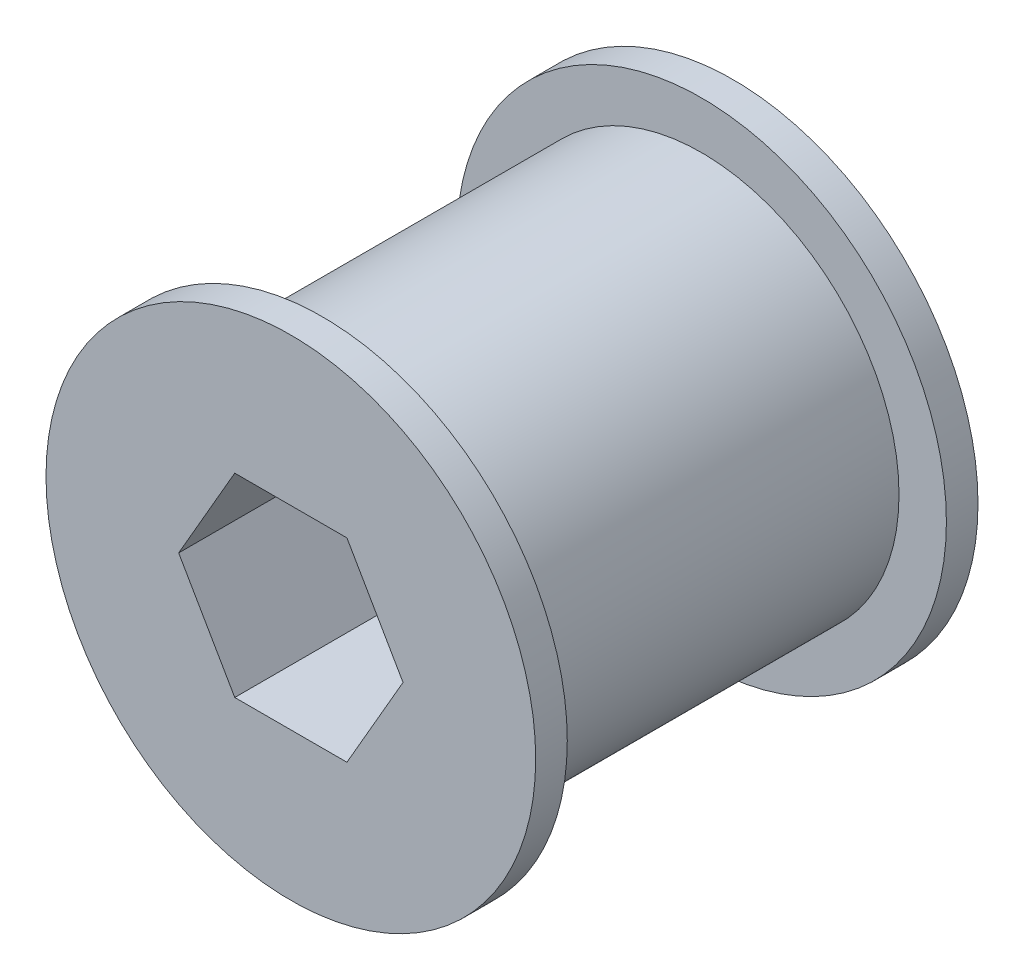
ISO-10303-21;
HEADER;
FILE_DESCRIPTION(('STEP AP214'),'2;1');
FILE_NAME('part.step','',(''),(''),'','','');
FILE_SCHEMA(('AUTOMOTIVE_DESIGN { 1 0 10303 214 1 1 1 1 }'));
ENDSEC;
DATA;
#1=APPLICATION_CONTEXT('core data for automotive mechanical design processes');
#2=APPLICATION_PROTOCOL_DEFINITION('international standard','automotive_design',2000,#1);
#3=PRODUCT_CONTEXT('',#1,'mechanical');
#4=PRODUCT('Part','Part','',(#3));
#5=PRODUCT_RELATED_PRODUCT_CATEGORY('part','',(#4));
#6=PRODUCT_DEFINITION_FORMATION('','',#4);
#7=PRODUCT_DEFINITION_CONTEXT('part definition',#1,'design');
#8=PRODUCT_DEFINITION('design','',#6,#7);
#9=PRODUCT_DEFINITION_SHAPE('','',#8);
#10=(LENGTH_UNIT() NAMED_UNIT(*) SI_UNIT(.MILLI.,.METRE.));
#11=(NAMED_UNIT(*) PLANE_ANGLE_UNIT() SI_UNIT($,.RADIAN.));
#12=(NAMED_UNIT(*) SI_UNIT($,.STERADIAN.) SOLID_ANGLE_UNIT());
#13=UNCERTAINTY_MEASURE_WITH_UNIT(LENGTH_MEASURE(1.E-05),#10,'distance_accuracy_value','');
#14=(GEOMETRIC_REPRESENTATION_CONTEXT(3) GLOBAL_UNCERTAINTY_ASSIGNED_CONTEXT((#13)) GLOBAL_UNIT_ASSIGNED_CONTEXT((#10,
#11,#12)) REPRESENTATION_CONTEXT('',''));
#15=CARTESIAN_POINT('',(0.,0.,0.));
#16=DIRECTION('',(0.,0.,1.));
#17=DIRECTION('',(1.,0.,0.));
#18=AXIS2_PLACEMENT_3D('',#15,#16,#17);
#19=CARTESIAN_POINT('',(0.,0.,-20.2225396744416));
#20=DIRECTION('',(0.,0.,1.));
#21=DIRECTION('',(1.,0.,0.));
#22=AXIS2_PLACEMENT_3D('',#19,#20,#21);
#23=CYLINDRICAL_SURFACE('',#22,2.2);
#24=CARTESIAN_POINT('',(0.,0.,0.));
#25=DIRECTION('',(0.,0.,1.));
#26=DIRECTION('',(1.,0.,0.));
#27=AXIS2_PLACEMENT_3D('',#24,#25,#26);
#28=CIRCLE('',#27,2.2);
#29=CARTESIAN_POINT('',(2.2,0.,0.));
#30=VERTEX_POINT('',#29);
#31=EDGE_CURVE('E297',#30,#30,#28,.T.);
#32=ORIENTED_EDGE('',*,*,#31,.T.);
#33=EDGE_LOOP('',(#32));
#34=FACE_BOUND('',#33,.T.);
#35=CARTESIAN_POINT('',(0.,0.,-4.));
#36=DIRECTION('',(0.,0.,-1.));
#37=DIRECTION('',(-1.,0.,0.));
#38=AXIS2_PLACEMENT_3D('',#35,#36,#37);
#39=CIRCLE('',#38,2.2);
#40=CARTESIAN_POINT('',(-2.2,0.,-4.));
#41=VERTEX_POINT('',#40);
#42=EDGE_CURVE('E45',#41,#41,#39,.F.);
#43=ORIENTED_EDGE('',*,*,#42,.F.);
#44=EDGE_LOOP('',(#43));
#45=FACE_BOUND('',#44,.T.);
#46=ADVANCED_FACE('F41',(#34,#45),#23,.F.);
#47=CARTESIAN_POINT('',(0.,0.,14.));
#48=DIRECTION('',(0.,0.,-1.));
#49=DIRECTION('',(-1.,0.,0.));
#50=AXIS2_PLACEMENT_3D('',#47,#48,#49);
#51=PLANE('',#50);
#52=CARTESIAN_POINT('',(0.,0.,14.));
#53=DIRECTION('',(0.,0.,-1.));
#54=DIRECTION('',(-1.,0.,0.));
#55=AXIS2_PLACEMENT_3D('',#52,#53,#54);
#56=CIRCLE('',#55,15.5);
#57=CARTESIAN_POINT('',(-15.5,0.,14.));
#58=VERTEX_POINT('',#57);
#59=EDGE_CURVE('E50',#58,#58,#56,.T.);
#60=ORIENTED_EDGE('',*,*,#59,.F.);
#61=EDGE_LOOP('',(#60));
#62=FACE_BOUND('',#61,.T.);
#63=DIRECTION('',(-0.5,0.866025403784439,0.));
#64=VECTOR('',#63,1.);
#65=CARTESIAN_POINT('',(-7.1014083110324,0.,14.));
#66=LINE('',#65,#64);
#67=CARTESIAN_POINT('',(-3.5507041555162,-6.15,14.));
#68=VERTEX_POINT('',#67);
#69=CARTESIAN_POINT('',(-7.1014083110324,0.,14.));
#70=VERTEX_POINT('',#69);
#71=EDGE_CURVE('E132',#68,#70,#66,.T.);
#72=ORIENTED_EDGE('',*,*,#71,.T.);
#73=DIRECTION('',(0.5,0.866025403784439,0.));
#74=VECTOR('',#73,1.);
#75=CARTESIAN_POINT('',(-3.5507041555162,6.15,14.));
#76=LINE('',#75,#74);
#77=CARTESIAN_POINT('',(-3.5507041555162,6.15,14.));
#78=VERTEX_POINT('',#77);
#79=EDGE_CURVE('E112',#70,#78,#76,.T.);
#80=ORIENTED_EDGE('',*,*,#79,.T.);
#81=DIRECTION('',(1.,0.,0.));
#82=VECTOR('',#81,1.);
#83=CARTESIAN_POINT('',(3.5507041555162,6.15,14.));
#84=LINE('',#83,#82);
#85=CARTESIAN_POINT('',(3.5507041555162,6.15,14.));
#86=VERTEX_POINT('',#85);
#87=EDGE_CURVE('E162',#78,#86,#84,.T.);
#88=ORIENTED_EDGE('',*,*,#87,.T.);
#89=DIRECTION('',(0.5,-0.866025403784439,0.));
#90=VECTOR('',#89,1.);
#91=CARTESIAN_POINT('',(7.1014083110324,0.,14.));
#92=LINE('',#91,#90);
#93=CARTESIAN_POINT('',(7.1014083110324,0.,14.));
#94=VERTEX_POINT('',#93);
#95=EDGE_CURVE('E146',#86,#94,#92,.T.);
#96=ORIENTED_EDGE('',*,*,#95,.T.);
#97=DIRECTION('',(-0.5,-0.866025403784439,0.));
#98=VECTOR('',#97,1.);
#99=CARTESIAN_POINT('',(3.5507041555162,-6.15,14.));
#100=LINE('',#99,#98);
#101=CARTESIAN_POINT('',(3.5507041555162,-6.15,14.));
#102=VERTEX_POINT('',#101);
#103=EDGE_CURVE('E142',#94,#102,#100,.T.);
#104=ORIENTED_EDGE('',*,*,#103,.T.);
#105=DIRECTION('',(-1.,0.,0.));
#106=VECTOR('',#105,1.);
#107=CARTESIAN_POINT('',(-3.5507041555162,-6.15,14.));
#108=LINE('',#107,#106);
#109=EDGE_CURVE('E138',#102,#68,#108,.T.);
#110=ORIENTED_EDGE('',*,*,#109,.T.);
#111=EDGE_LOOP('',(#72,#80,#88,#96,#104,#110));
#112=FACE_BOUND('',#111,.T.);
#113=ADVANCED_FACE('F163',(#62,#112),#51,.F.);
#114=CARTESIAN_POINT('',(0.,0.,12.));
#115=DIRECTION('',(0.,0.,-1.));
#116=DIRECTION('',(-1.,0.,0.));
#117=AXIS2_PLACEMENT_3D('',#114,#115,#116);
#118=CYLINDRICAL_SURFACE('',#117,12.5);
#119=CARTESIAN_POINT('',(0.,0.,12.));
#120=DIRECTION('',(0.,0.,1.));
#121=DIRECTION('',(1.,0.,0.));
#122=AXIS2_PLACEMENT_3D('',#119,#120,#121);
#123=CIRCLE('',#122,12.5);
#124=CARTESIAN_POINT('',(12.5,0.,12.));
#125=VERTEX_POINT('',#124);
#126=EDGE_CURVE('E12',#125,#125,#123,.T.);
#127=ORIENTED_EDGE('',*,*,#126,.F.);
#128=EDGE_LOOP('',(#127));
#129=FACE_BOUND('',#128,.T.);
#130=CARTESIAN_POINT('',(0.,0.,-12.));
#131=DIRECTION('',(0.,0.,1.));
#132=DIRECTION('',(1.,0.,0.));
#133=AXIS2_PLACEMENT_3D('',#130,#131,#132);
#134=CIRCLE('',#133,12.5);
#135=CARTESIAN_POINT('',(12.5,0.,-12.));
#136=VERTEX_POINT('',#135);
#137=EDGE_CURVE('E152',#136,#136,#134,.T.);
#138=ORIENTED_EDGE('',*,*,#137,.T.);
#139=EDGE_LOOP('',(#138));
#140=FACE_BOUND('',#139,.T.);
#141=ADVANCED_FACE('F43',(#129,#140),#118,.T.);
#142=CARTESIAN_POINT('',(0.,0.,14.));
#143=DIRECTION('',(0.,0.,-1.));
#144=DIRECTION('',(-1.,0.,0.));
#145=AXIS2_PLACEMENT_3D('',#142,#143,#144);
#146=CYLINDRICAL_SURFACE('',#145,15.5);
#147=ORIENTED_EDGE('',*,*,#59,.T.);
#148=EDGE_LOOP('',(#147));
#149=FACE_BOUND('',#148,.T.);
#150=CARTESIAN_POINT('',(0.,0.,12.));
#151=DIRECTION('',(0.,0.,-1.));
#152=DIRECTION('',(-1.,0.,0.));
#153=AXIS2_PLACEMENT_3D('',#150,#151,#152);
#154=CIRCLE('',#153,15.5);
#155=CARTESIAN_POINT('',(-15.5,0.,12.));
#156=VERTEX_POINT('',#155);
#157=EDGE_CURVE('E136',#156,#156,#154,.T.);
#158=ORIENTED_EDGE('',*,*,#157,.F.);
#159=EDGE_LOOP('',(#158));
#160=FACE_BOUND('',#159,.T.);
#161=ADVANCED_FACE('F238',(#149,#160),#146,.T.);
#162=CARTESIAN_POINT('',(0.,0.,12.));
#163=DIRECTION('',(0.,0.,-1.));
#164=DIRECTION('',(-1.,0.,0.));
#165=AXIS2_PLACEMENT_3D('',#162,#163,#164);
#166=PLANE('',#165);
#167=ORIENTED_EDGE('',*,*,#126,.T.);
#168=EDGE_LOOP('',(#167));
#169=FACE_BOUND('',#168,.T.);
#170=ORIENTED_EDGE('',*,*,#157,.T.);
#171=EDGE_LOOP('',(#170));
#172=FACE_BOUND('',#171,.T.);
#173=ADVANCED_FACE('F208',(#169,#172),#166,.T.);
#174=CARTESIAN_POINT('',(-7.1014083110324,0.,32.7885603493189));
#175=DIRECTION('',(0.866025403784439,0.5,0.));
#176=DIRECTION('',(-0.5,0.866025403784439,0.));
#177=AXIS2_PLACEMENT_3D('',#174,#175,#176);
#178=PLANE('',#177);
#179=DIRECTION('',(0.,0.,-1.));
#180=VECTOR('',#179,1.);
#181=CARTESIAN_POINT('',(-3.5507041555162,-6.15,32.7885603493189));
#182=LINE('',#181,#180);
#183=CARTESIAN_POINT('',(-3.5507041555162,-6.15,0.));
#184=VERTEX_POINT('',#183);
#185=EDGE_CURVE('E65',#68,#184,#182,.T.);
#186=ORIENTED_EDGE('',*,*,#185,.T.);
#187=DIRECTION('',(0.5,-0.866025403784438,0.));
#188=VECTOR('',#187,1.);
#189=CARTESIAN_POINT('',(-7.1014083110324,0.,0.));
#190=LINE('',#189,#188);
#191=CARTESIAN_POINT('',(-7.1014083110324,0.,0.));
#192=VERTEX_POINT('',#191);
#193=EDGE_CURVE('E96',#192,#184,#190,.T.);
#194=ORIENTED_EDGE('',*,*,#193,.F.);
#195=DIRECTION('',(0.,0.,-1.));
#196=VECTOR('',#195,1.);
#197=CARTESIAN_POINT('',(-7.1014083110324,0.,32.7885603493189));
#198=LINE('',#197,#196);
#199=EDGE_CURVE('E99',#70,#192,#198,.T.);
#200=ORIENTED_EDGE('',*,*,#199,.F.);
#201=ORIENTED_EDGE('',*,*,#71,.F.);
#202=EDGE_LOOP('',(#186,#194,#200,#201));
#203=FACE_BOUND('',#202,.T.);
#204=ADVANCED_FACE('F98',(#203),#178,.T.);
#205=CARTESIAN_POINT('',(-3.5507041555162,6.15,32.7885603493189));
#206=DIRECTION('',(0.866025403784439,-0.5,0.));
#207=DIRECTION('',(0.5,0.866025403784439,0.));
#208=AXIS2_PLACEMENT_3D('',#205,#206,#207);
#209=PLANE('',#208);
#210=ORIENTED_EDGE('',*,*,#199,.T.);
#211=DIRECTION('',(-0.5,-0.866025403784439,0.));
#212=VECTOR('',#211,1.);
#213=CARTESIAN_POINT('',(-3.5507041555162,6.15,0.));
#214=LINE('',#213,#212);
#215=CARTESIAN_POINT('',(-3.5507041555162,6.15,0.));
#216=VERTEX_POINT('',#215);
#217=EDGE_CURVE('E104',#216,#192,#214,.T.);
#218=ORIENTED_EDGE('',*,*,#217,.F.);
#219=DIRECTION('',(0.,0.,-1.));
#220=VECTOR('',#219,1.);
#221=CARTESIAN_POINT('',(-3.5507041555162,6.15,32.7885603493189));
#222=LINE('',#221,#220);
#223=EDGE_CURVE('E113',#78,#216,#222,.T.);
#224=ORIENTED_EDGE('',*,*,#223,.F.);
#225=ORIENTED_EDGE('',*,*,#79,.F.);
#226=EDGE_LOOP('',(#210,#218,#224,#225));
#227=FACE_BOUND('',#226,.T.);
#228=ADVANCED_FACE('F108',(#227),#209,.T.);
#229=CARTESIAN_POINT('',(3.5507041555162,6.15,32.7885603493189));
#230=DIRECTION('',(0.,-1.,0.));
#231=DIRECTION('',(0.,0.,-1.));
#232=AXIS2_PLACEMENT_3D('',#229,#230,#231);
#233=PLANE('',#232);
#234=ORIENTED_EDGE('',*,*,#223,.T.);
#235=DIRECTION('',(-1.,0.,0.));
#236=VECTOR('',#235,1.);
#237=CARTESIAN_POINT('',(3.5507041555162,6.15,0.));
#238=LINE('',#237,#236);
#239=CARTESIAN_POINT('',(3.5507041555162,6.15,0.));
#240=VERTEX_POINT('',#239);
#241=EDGE_CURVE('E118',#240,#216,#238,.T.);
#242=ORIENTED_EDGE('',*,*,#241,.F.);
#243=DIRECTION('',(0.,0.,-1.));
#244=VECTOR('',#243,1.);
#245=CARTESIAN_POINT('',(3.5507041555162,6.15,32.7885603493189));
#246=LINE('',#245,#244);
#247=EDGE_CURVE('E126',#86,#240,#246,.T.);
#248=ORIENTED_EDGE('',*,*,#247,.F.);
#249=ORIENTED_EDGE('',*,*,#87,.F.);
#250=EDGE_LOOP('',(#234,#242,#248,#249));
#251=FACE_BOUND('',#250,.T.);
#252=ADVANCED_FACE('F161',(#251),#233,.T.);
#253=CARTESIAN_POINT('',(7.1014083110324,0.,32.7885603493189));
#254=DIRECTION('',(-0.866025403784438,-0.5,0.));
#255=DIRECTION('',(0.5,-0.866025403784439,0.));
#256=AXIS2_PLACEMENT_3D('',#253,#254,#255);
#257=PLANE('',#256);
#258=ORIENTED_EDGE('',*,*,#247,.T.);
#259=DIRECTION('',(-0.5,0.866025403784439,0.));
#260=VECTOR('',#259,1.);
#261=CARTESIAN_POINT('',(7.1014083110324,0.,0.));
#262=LINE('',#261,#260);
#263=CARTESIAN_POINT('',(7.1014083110324,0.,0.));
#264=VERTEX_POINT('',#263);
#265=EDGE_CURVE('E120',#264,#240,#262,.T.);
#266=ORIENTED_EDGE('',*,*,#265,.F.);
#267=DIRECTION('',(0.,0.,-1.));
#268=VECTOR('',#267,1.);
#269=CARTESIAN_POINT('',(7.1014083110324,0.,32.7885603493189));
#270=LINE('',#269,#268);
#271=EDGE_CURVE('E128',#94,#264,#270,.T.);
#272=ORIENTED_EDGE('',*,*,#271,.F.);
#273=ORIENTED_EDGE('',*,*,#95,.F.);
#274=EDGE_LOOP('',(#258,#266,#272,#273));
#275=FACE_BOUND('',#274,.T.);
#276=ADVANCED_FACE('F156',(#275),#257,.T.);
#277=CARTESIAN_POINT('',(3.5507041555162,-6.15,32.7885603493189));
#278=DIRECTION('',(-0.866025403784439,0.5,0.));
#279=DIRECTION('',(-0.5,-0.866025403784439,0.));
#280=AXIS2_PLACEMENT_3D('',#277,#278,#279);
#281=PLANE('',#280);
#282=ORIENTED_EDGE('',*,*,#271,.T.);
#283=DIRECTION('',(0.5,0.866025403784439,0.));
#284=VECTOR('',#283,1.);
#285=CARTESIAN_POINT('',(3.5507041555162,-6.15,0.));
#286=LINE('',#285,#284);
#287=CARTESIAN_POINT('',(3.5507041555162,-6.15,0.));
#288=VERTEX_POINT('',#287);
#289=EDGE_CURVE('E57',#288,#264,#286,.T.);
#290=ORIENTED_EDGE('',*,*,#289,.F.);
#291=DIRECTION('',(0.,0.,-1.));
#292=VECTOR('',#291,1.);
#293=CARTESIAN_POINT('',(3.5507041555162,-6.15,32.7885603493189));
#294=LINE('',#293,#292);
#295=EDGE_CURVE('E130',#102,#288,#294,.T.);
#296=ORIENTED_EDGE('',*,*,#295,.F.);
#297=ORIENTED_EDGE('',*,*,#103,.F.);
#298=EDGE_LOOP('',(#282,#290,#296,#297));
#299=FACE_BOUND('',#298,.T.);
#300=ADVANCED_FACE('F168',(#299),#281,.T.);
#301=CARTESIAN_POINT('',(-3.5507041555162,-6.15,32.7885603493189));
#302=DIRECTION('',(0.,1.,0.));
#303=DIRECTION('',(-1.,0.,0.));
#304=AXIS2_PLACEMENT_3D('',#301,#302,#303);
#305=PLANE('',#304);
#306=ORIENTED_EDGE('',*,*,#295,.T.);
#307=DIRECTION('',(1.,0.,0.));
#308=VECTOR('',#307,1.);
#309=CARTESIAN_POINT('',(-3.5507041555162,-6.15,0.));
#310=LINE('',#309,#308);
#311=EDGE_CURVE('E150',#184,#288,#310,.T.);
#312=ORIENTED_EDGE('',*,*,#311,.F.);
#313=ORIENTED_EDGE('',*,*,#185,.F.);
#314=ORIENTED_EDGE('',*,*,#109,.F.);
#315=EDGE_LOOP('',(#306,#312,#313,#314));
#316=FACE_BOUND('',#315,.T.);
#317=ADVANCED_FACE('F169',(#316),#305,.T.);
#318=CARTESIAN_POINT('',(0.,0.,0.));
#319=DIRECTION('',(0.,0.,-1.));
#320=DIRECTION('',(1.,0.,0.));
#321=AXIS2_PLACEMENT_3D('',#318,#319,#320);
#322=PLANE('',#321);
#323=ORIENTED_EDGE('',*,*,#31,.F.);
#324=EDGE_LOOP('',(#323));
#325=FACE_BOUND('',#324,.T.);
#326=ORIENTED_EDGE('',*,*,#217,.T.);
#327=ORIENTED_EDGE('',*,*,#193,.T.);
#328=ORIENTED_EDGE('',*,*,#311,.T.);
#329=ORIENTED_EDGE('',*,*,#289,.T.);
#330=ORIENTED_EDGE('',*,*,#265,.T.);
#331=ORIENTED_EDGE('',*,*,#241,.T.);
#332=EDGE_LOOP('',(#326,#327,#328,#329,#330,#331));
#333=FACE_BOUND('',#332,.T.);
#334=ADVANCED_FACE('F115',(#325,#333),#322,.F.);
#335=CARTESIAN_POINT('',(0.,0.,-14.));
#336=DIRECTION('',(0.,0.,1.));
#337=DIRECTION('',(1.,0.,0.));
#338=AXIS2_PLACEMENT_3D('',#335,#336,#337);
#339=CYLINDRICAL_SURFACE('',#338,15.5);
#340=CARTESIAN_POINT('',(0.,0.,-14.));
#341=DIRECTION('',(0.,0.,-1.));
#342=DIRECTION('',(-1.,0.,0.));
#343=AXIS2_PLACEMENT_3D('',#340,#341,#342);
#344=CIRCLE('',#343,15.5);
#345=CARTESIAN_POINT('',(-15.5,0.,-14.));
#346=VERTEX_POINT('',#345);
#347=EDGE_CURVE('E300',#346,#346,#344,.T.);
#348=ORIENTED_EDGE('',*,*,#347,.F.);
#349=EDGE_LOOP('',(#348));
#350=FACE_BOUND('',#349,.T.);
#351=CARTESIAN_POINT('',(0.,0.,-12.));
#352=DIRECTION('',(0.,0.,-1.));
#353=DIRECTION('',(-1.,0.,0.));
#354=AXIS2_PLACEMENT_3D('',#351,#352,#353);
#355=CIRCLE('',#354,15.5);
#356=CARTESIAN_POINT('',(-15.5,0.,-12.));
#357=VERTEX_POINT('',#356);
#358=EDGE_CURVE('E299',#357,#357,#355,.T.);
#359=ORIENTED_EDGE('',*,*,#358,.T.);
#360=EDGE_LOOP('',(#359));
#361=FACE_BOUND('',#360,.T.);
#362=ADVANCED_FACE('F177',(#350,#361),#339,.T.);
#363=CARTESIAN_POINT('',(0.,0.,-14.));
#364=DIRECTION('',(0.,0.,1.));
#365=DIRECTION('',(-1.,0.,0.));
#366=AXIS2_PLACEMENT_3D('',#363,#364,#365);
#367=PLANE('',#366);
#368=CARTESIAN_POINT('',(0.,0.,-14.));
#369=DIRECTION('',(0.,0.,-1.));
#370=DIRECTION('',(-1.,0.,0.));
#371=AXIS2_PLACEMENT_3D('',#368,#369,#370);
#372=CIRCLE('',#371,6.15);
#373=CARTESIAN_POINT('',(-6.15,0.,-14.));
#374=VERTEX_POINT('',#373);
#375=EDGE_CURVE('E293',#374,#374,#372,.T.);
#376=ORIENTED_EDGE('',*,*,#375,.F.);
#377=EDGE_LOOP('',(#376));
#378=FACE_BOUND('',#377,.T.);
#379=ORIENTED_EDGE('',*,*,#347,.T.);
#380=EDGE_LOOP('',(#379));
#381=FACE_BOUND('',#380,.T.);
#382=ADVANCED_FACE('F196',(#378,#381),#367,.F.);
#383=CARTESIAN_POINT('',(0.,0.,-12.));
#384=DIRECTION('',(0.,0.,1.));
#385=DIRECTION('',(-1.,0.,0.));
#386=AXIS2_PLACEMENT_3D('',#383,#384,#385);
#387=PLANE('',#386);
#388=ORIENTED_EDGE('',*,*,#137,.F.);
#389=EDGE_LOOP('',(#388));
#390=FACE_BOUND('',#389,.T.);
#391=ORIENTED_EDGE('',*,*,#358,.F.);
#392=EDGE_LOOP('',(#391));
#393=FACE_BOUND('',#392,.T.);
#394=ADVANCED_FACE('F198',(#390,#393),#387,.T.);
#395=CARTESIAN_POINT('',(0.,0.,-4.));
#396=DIRECTION('',(0.,0.,-1.));
#397=DIRECTION('',(1.,0.,0.));
#398=AXIS2_PLACEMENT_3D('',#395,#396,#397);
#399=PLANE('',#398);
#400=CARTESIAN_POINT('',(0.,0.,-4.));
#401=DIRECTION('',(0.,0.,-1.));
#402=DIRECTION('',(-1.,0.,0.));
#403=AXIS2_PLACEMENT_3D('',#400,#401,#402);
#404=CIRCLE('',#403,6.15);
#405=CARTESIAN_POINT('',(-6.15,0.,-4.));
#406=VERTEX_POINT('',#405);
#407=EDGE_CURVE('E290',#406,#406,#404,.F.);
#408=ORIENTED_EDGE('',*,*,#407,.F.);
#409=EDGE_LOOP('',(#408));
#410=FACE_BOUND('',#409,.T.);
#411=ORIENTED_EDGE('',*,*,#42,.T.);
#412=EDGE_LOOP('',(#411));
#413=FACE_BOUND('',#412,.T.);
#414=ADVANCED_FACE('F202',(#410,#413),#399,.T.);
#415=CARTESIAN_POINT('',(0.,0.,17.3948268171891));
#416=DIRECTION('',(0.,0.,-1.));
#417=DIRECTION('',(-1.,0.,0.));
#418=AXIS2_PLACEMENT_3D('',#415,#416,#417);
#419=CYLINDRICAL_SURFACE('',#418,6.15);
#420=ORIENTED_EDGE('',*,*,#407,.T.);
#421=EDGE_LOOP('',(#420));
#422=FACE_BOUND('',#421,.T.);
#423=ORIENTED_EDGE('',*,*,#375,.T.);
#424=EDGE_LOOP('',(#423));
#425=FACE_BOUND('',#424,.T.);
#426=ADVANCED_FACE('F194',(#422,#425),#419,.F.);
#427=CLOSED_SHELL('',(#46,#113,#141,#161,#173,#204,#228,#252,#276,#300,#317,#334,#362,#382,#394,
#414,#426));
#428=MANIFOLD_SOLID_BREP('B2',#427);
#429=ADVANCED_BREP_SHAPE_REPRESENTATION('',(#18,#428),#14);
#430=SHAPE_DEFINITION_REPRESENTATION(#9,#429);
ENDSEC;
END-ISO-10303-21;
